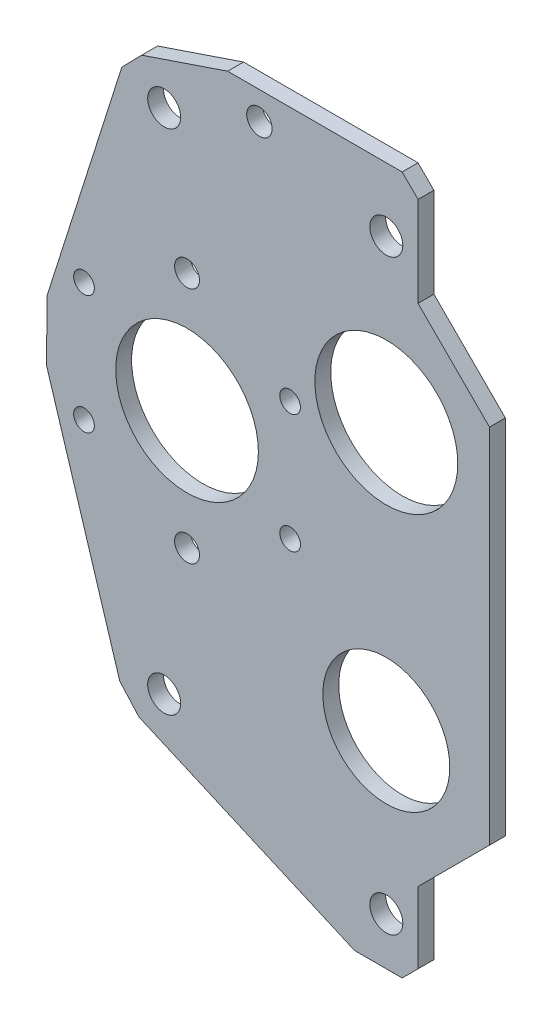
ISO-10303-21;
HEADER;
FILE_DESCRIPTION(('STEP AP214'),'2;1');
FILE_NAME('part.step','',(''),(''),'','','');
FILE_SCHEMA(('AUTOMOTIVE_DESIGN { 1 0 10303 214 1 1 1 1 }'));
ENDSEC;
DATA;
#1=APPLICATION_CONTEXT('core data for automotive mechanical design processes');
#2=APPLICATION_PROTOCOL_DEFINITION('international standard','automotive_design',2000,#1);
#3=PRODUCT_CONTEXT('',#1,'mechanical');
#4=PRODUCT('Part','Part','',(#3));
#5=PRODUCT_RELATED_PRODUCT_CATEGORY('part','',(#4));
#6=PRODUCT_DEFINITION_FORMATION('','',#4);
#7=PRODUCT_DEFINITION_CONTEXT('part definition',#1,'design');
#8=PRODUCT_DEFINITION('design','',#6,#7);
#9=PRODUCT_DEFINITION_SHAPE('','',#8);
#10=(LENGTH_UNIT() NAMED_UNIT(*) SI_UNIT(.MILLI.,.METRE.));
#11=(NAMED_UNIT(*) PLANE_ANGLE_UNIT() SI_UNIT($,.RADIAN.));
#12=(NAMED_UNIT(*) SI_UNIT($,.STERADIAN.) SOLID_ANGLE_UNIT());
#13=UNCERTAINTY_MEASURE_WITH_UNIT(LENGTH_MEASURE(1.E-05),#10,'distance_accuracy_value','');
#14=(GEOMETRIC_REPRESENTATION_CONTEXT(3) GLOBAL_UNCERTAINTY_ASSIGNED_CONTEXT((#13)) GLOBAL_UNIT_ASSIGNED_CONTEXT((#10,
#11,#12)) REPRESENTATION_CONTEXT('',''));
#15=CARTESIAN_POINT('',(0.,0.,0.));
#16=DIRECTION('',(0.,0.,1.));
#17=DIRECTION('',(1.,0.,0.));
#18=AXIS2_PLACEMENT_3D('',#15,#16,#17);
#19=CARTESIAN_POINT('',(0.,0.,0.));
#20=DIRECTION('',(0.,0.,1.));
#21=DIRECTION('',(1.,0.,0.));
#22=AXIS2_PLACEMENT_3D('',#19,#20,#21);
#23=PLANE('',#22);
#24=DIRECTION('',(-0.947188076798087,-0.32067857298476,0.));
#25=VECTOR('',#24,1.);
#26=CARTESIAN_POINT('',(-33.1609002039906,97.9473277455423,0.));
#27=LINE('',#26,#25);
#28=CARTESIAN_POINT('',(-48.9538078594664,92.6005046443076,0.));
#29=VERTEX_POINT('',#28);
#30=CARTESIAN_POINT('',(-31.75,98.425,0.));
#31=VERTEX_POINT('',#30);
#32=EDGE_CURVE('E696',#29,#31,#27,.F.);
#33=ORIENTED_EDGE('',*,*,#32,.F.);
#34=DIRECTION('',(0.7004757379388,0.713676215492077,0.));
#35=VECTOR('',#34,1.);
#36=CARTESIAN_POINT('',(-48.9538078594664,92.6005046443076,0.));
#37=LINE('',#36,#35);
#38=CARTESIAN_POINT('',(-52.9229679271194,88.5565456856429,0.));
#39=VERTEX_POINT('',#38);
#40=EDGE_CURVE('E688',#29,#39,#37,.F.);
#41=ORIENTED_EDGE('',*,*,#40,.T.);
#42=DIRECTION('',(-0.302941078368201,-0.953009288011985,0.));
#43=VECTOR('',#42,1.);
#44=CARTESIAN_POINT('',(-73.6328287693253,23.4062866241446,0.));
#45=LINE('',#44,#43);
#46=CARTESIAN_POINT('',(-67.9263241523619,41.3581336676134,0.));
#47=VERTEX_POINT('',#46);
#48=EDGE_CURVE('E686',#47,#39,#45,.F.);
#49=ORIENTED_EDGE('',*,*,#48,.F.);
#50=DIRECTION('',(0.00396394921512312,0.999992143522448,0.));
#51=VECTOR('',#50,1.);
#52=CARTESIAN_POINT('',(-67.9263241523619,41.3581336676133,0.));
#53=LINE('',#52,#51);
#54=CARTESIAN_POINT('',(-67.9743607697863,29.2398552995184,0.));
#55=VERTEX_POINT('',#54);
#56=EDGE_CURVE('E679',#47,#55,#53,.F.);
#57=ORIENTED_EDGE('',*,*,#56,.T.);
#58=DIRECTION('',(0.295376256726555,-0.955381006176179,0.));
#59=VECTOR('',#58,1.);
#60=CARTESIAN_POINT('',(-53.7923971636767,-16.6310579882147,0.));
#61=LINE('',#60,#59);
#62=CARTESIAN_POINT('',(-53.3456573135953,-18.0760176210564,0.));
#63=VERTEX_POINT('',#62);
#64=EDGE_CURVE('E145',#63,#55,#61,.F.);
#65=ORIENTED_EDGE('',*,*,#64,.F.);
#66=DIRECTION('',(-0.666107578502949,0.745855678976126,0.));
#67=VECTOR('',#66,1.);
#68=CARTESIAN_POINT('',(-53.3456573135953,-18.0760176210564,0.));
#69=LINE('',#68,#67);
#70=CARTESIAN_POINT('',(-49.4993940732019,-22.3827653195768,0.));
#71=VERTEX_POINT('',#70);
#72=EDGE_CURVE('E140',#63,#71,#69,.F.);
#73=ORIENTED_EDGE('',*,*,#72,.T.);
#74=DIRECTION('',(0.916045236310745,-0.401074961861734,0.));
#75=VECTOR('',#74,1.);
#76=CARTESIAN_POINT('',(-16.1860190531105,-36.9684648964657,0.));
#77=LINE('',#76,#75);
#78=CARTESIAN_POINT('',(-6.34999999999987,-41.275,0.));
#79=VERTEX_POINT('',#78);
#80=EDGE_CURVE('E131',#79,#71,#77,.F.);
#81=ORIENTED_EDGE('',*,*,#80,.F.);
#82=DIRECTION('',(1.,0.,0.));
#83=VECTOR('',#82,1.);
#84=CARTESIAN_POINT('',(-76.2,-41.275,0.));
#85=LINE('',#84,#83);
#86=CARTESIAN_POINT('',(3.17499999999999,-41.275,0.));
#87=VERTEX_POINT('',#86);
#88=EDGE_CURVE('E126',#87,#79,#85,.F.);
#89=ORIENTED_EDGE('',*,*,#88,.F.);
#90=DIRECTION('',(0.707106781186547,0.707106781186548,0.));
#91=VECTOR('',#90,1.);
#92=CARTESIAN_POINT('',(6.35,-38.1,0.));
#93=LINE('',#92,#91);
#94=CARTESIAN_POINT('',(6.35,-38.1,0.));
#95=VERTEX_POINT('',#94);
#96=EDGE_CURVE('E733',#95,#87,#93,.F.);
#97=ORIENTED_EDGE('',*,*,#96,.F.);
#98=DIRECTION('',(0.,-1.,0.));
#99=VECTOR('',#98,1.);
#100=CARTESIAN_POINT('',(6.35000000000001,-23.8252,0.));
#101=LINE('',#100,#99);
#102=CARTESIAN_POINT('',(6.35,-23.8252,0.));
#103=VERTEX_POINT('',#102);
#104=EDGE_CURVE('E727',#95,#103,#101,.F.);
#105=ORIENTED_EDGE('',*,*,#104,.T.);
#106=DIRECTION('',(-0.707106781186549,-0.707106781186546,0.));
#107=VECTOR('',#106,1.);
#108=CARTESIAN_POINT('',(20.6502,-9.525,0.));
#109=LINE('',#108,#107);
#110=CARTESIAN_POINT('',(20.6502,-9.52500000000001,0.));
#111=VERTEX_POINT('',#110);
#112=EDGE_CURVE('E722',#103,#111,#109,.F.);
#113=ORIENTED_EDGE('',*,*,#112,.T.);
#114=DIRECTION('',(0.,-1.,0.));
#115=VECTOR('',#114,1.);
#116=CARTESIAN_POINT('',(20.6502,62.9412,0.));
#117=LINE('',#116,#115);
#118=CARTESIAN_POINT('',(20.6502,62.9412,0.));
#119=VERTEX_POINT('',#118);
#120=EDGE_CURVE('E717',#111,#119,#117,.F.);
#121=ORIENTED_EDGE('',*,*,#120,.T.);
#122=DIRECTION('',(0.707106781186549,-0.707106781186546,0.));
#123=VECTOR('',#122,1.);
#124=CARTESIAN_POINT('',(6.35000000000002,77.2414,0.));
#125=LINE('',#124,#123);
#126=CARTESIAN_POINT('',(6.35000000000002,77.2414,0.));
#127=VERTEX_POINT('',#126);
#128=EDGE_CURVE('E712',#119,#127,#125,.F.);
#129=ORIENTED_EDGE('',*,*,#128,.T.);
#130=DIRECTION('',(0.,-1.,0.));
#131=VECTOR('',#130,1.);
#132=CARTESIAN_POINT('',(6.35000000000002,98.425,0.));
#133=LINE('',#132,#131);
#134=CARTESIAN_POINT('',(6.35000000000002,95.25,0.));
#135=VERTEX_POINT('',#134);
#136=EDGE_CURVE('E706',#127,#135,#133,.F.);
#137=ORIENTED_EDGE('',*,*,#136,.T.);
#138=DIRECTION('',(-0.707106781186547,0.707106781186548,0.));
#139=VECTOR('',#138,1.);
#140=CARTESIAN_POINT('',(3.17500000000003,98.425,0.));
#141=LINE('',#140,#139);
#142=CARTESIAN_POINT('',(3.17500000000003,98.425,0.));
#143=VERTEX_POINT('',#142);
#144=EDGE_CURVE('E704',#143,#135,#141,.F.);
#145=ORIENTED_EDGE('',*,*,#144,.F.);
#146=DIRECTION('',(1.,0.,0.));
#147=VECTOR('',#146,1.);
#148=CARTESIAN_POINT('',(-76.2,98.425,0.));
#149=LINE('',#148,#147);
#150=EDGE_CURVE('E700',#31,#143,#149,.T.);
#151=ORIENTED_EDGE('',*,*,#150,.F.);
#152=EDGE_LOOP('',(#33,#41,#49,#57,#65,#73,#81,#89,#97,#105,#113,#121,#129,#137,#145,#151));
#153=FACE_BOUND('',#152,.T.);
#154=CARTESIAN_POINT('',(0.,-31.75,0.));
#155=DIRECTION('',(0.,0.,1.));
#156=DIRECTION('',(1.,0.,0.));
#157=AXIS2_PLACEMENT_3D('',#154,#155,#156);
#158=CIRCLE('',#157,3.302);
#159=CARTESIAN_POINT('',(3.30199999999998,-31.75,0.));
#160=VERTEX_POINT('',#159);
#161=EDGE_CURVE('E149',#160,#160,#158,.F.);
#162=ORIENTED_EDGE('',*,*,#161,.T.);
#163=EDGE_LOOP('',(#162));
#164=FACE_BOUND('',#163,.T.);
#165=CARTESIAN_POINT('',(0.,85.725,0.));
#166=DIRECTION('',(0.,0.,1.));
#167=DIRECTION('',(1.,0.,0.));
#168=AXIS2_PLACEMENT_3D('',#165,#166,#167);
#169=CIRCLE('',#168,3.30199999999999);
#170=CARTESIAN_POINT('',(3.30199999999996,85.725,0.));
#171=VERTEX_POINT('',#170);
#172=EDGE_CURVE('E203',#171,#171,#169,.F.);
#173=ORIENTED_EDGE('',*,*,#172,.T.);
#174=EDGE_LOOP('',(#173));
#175=FACE_BOUND('',#174,.T.);
#176=CARTESIAN_POINT('',(-25.4,92.8624,0.));
#177=DIRECTION('',(0.,0.,1.));
#178=DIRECTION('',(1.,0.,0.));
#179=AXIS2_PLACEMENT_3D('',#176,#177,#178);
#180=CIRCLE('',#179,2.54);
#181=CARTESIAN_POINT('',(-22.86,92.8624,0.));
#182=VERTEX_POINT('',#181);
#183=EDGE_CURVE('E206',#182,#182,#180,.F.);
#184=ORIENTED_EDGE('',*,*,#183,.T.);
#185=EDGE_LOOP('',(#184));
#186=FACE_BOUND('',#185,.T.);
#187=CARTESIAN_POINT('',(0.,53.4162,0.));
#188=DIRECTION('',(0.,0.,1.));
#189=DIRECTION('',(1.,0.,0.));
#190=AXIS2_PLACEMENT_3D('',#187,#188,#189);
#191=CIRCLE('',#190,14.3002);
#192=CARTESIAN_POINT('',(14.3002,53.4162,0.));
#193=VERTEX_POINT('',#192);
#194=EDGE_CURVE('E209',#193,#193,#191,.F.);
#195=ORIENTED_EDGE('',*,*,#194,.T.);
#196=EDGE_LOOP('',(#195));
#197=FACE_BOUND('',#196,.T.);
#198=CARTESIAN_POINT('',(-39.878,35.5392112804997,0.));
#199=DIRECTION('',(0.,0.,1.));
#200=DIRECTION('',(1.,0.,0.));
#201=AXIS2_PLACEMENT_3D('',#198,#199,#200);
#202=CIRCLE('',#201,14.2748);
#203=CARTESIAN_POINT('',(-25.6032,35.5392112804997,0.));
#204=VERTEX_POINT('',#203);
#205=EDGE_CURVE('E212',#204,#204,#202,.F.);
#206=ORIENTED_EDGE('',*,*,#205,.T.);
#207=EDGE_LOOP('',(#206));
#208=FACE_BOUND('',#207,.T.);
#209=CARTESIAN_POINT('',(0.,0.,0.));
#210=DIRECTION('',(0.,0.,1.));
#211=DIRECTION('',(1.,0.,0.));
#212=AXIS2_PLACEMENT_3D('',#209,#210,#211);
#213=CIRCLE('',#212,12.7);
#214=CARTESIAN_POINT('',(12.7,0.,0.));
#215=VERTEX_POINT('',#214);
#216=EDGE_CURVE('E215',#215,#215,#213,.F.);
#217=ORIENTED_EDGE('',*,*,#216,.T.);
#218=EDGE_LOOP('',(#217));
#219=FACE_BOUND('',#218,.T.);
#220=CARTESIAN_POINT('',(-44.45,-15.875,0.));
#221=DIRECTION('',(0.,0.,1.));
#222=DIRECTION('',(1.,0.,0.));
#223=AXIS2_PLACEMENT_3D('',#220,#221,#222);
#224=CIRCLE('',#223,3.302);
#225=CARTESIAN_POINT('',(-41.148,-15.875,0.));
#226=VERTEX_POINT('',#225);
#227=EDGE_CURVE('E218',#226,#226,#224,.F.);
#228=ORIENTED_EDGE('',*,*,#227,.T.);
#229=EDGE_LOOP('',(#228));
#230=FACE_BOUND('',#229,.T.);
#231=CARTESIAN_POINT('',(-44.45,85.725,0.));
#232=DIRECTION('',(0.,0.,1.));
#233=DIRECTION('',(1.,0.,0.));
#234=AXIS2_PLACEMENT_3D('',#231,#232,#233);
#235=CIRCLE('',#234,3.302);
#236=CARTESIAN_POINT('',(-41.148,85.725,0.));
#237=VERTEX_POINT('',#236);
#238=EDGE_CURVE('E221',#237,#237,#235,.F.);
#239=ORIENTED_EDGE('',*,*,#238,.T.);
#240=EDGE_LOOP('',(#239));
#241=FACE_BOUND('',#240,.T.);
#242=CARTESIAN_POINT('',(-39.878,11.7267112804997,0.));
#243=DIRECTION('',(0.,0.,-1.));
#244=DIRECTION('',(-1.,0.,0.));
#245=AXIS2_PLACEMENT_3D('',#242,#243,#244);
#246=CIRCLE('',#245,2.4892);
#247=CARTESIAN_POINT('',(-42.3672,11.7267112804997,0.));
#248=VERTEX_POINT('',#247);
#249=EDGE_CURVE('E224',#248,#248,#246,.T.);
#250=ORIENTED_EDGE('',*,*,#249,.T.);
#251=EDGE_LOOP('',(#250));
#252=FACE_BOUND('',#251,.T.);
#253=CARTESIAN_POINT('',(-19.255770072383,23.6329612804998,0.));
#254=DIRECTION('',(0.,0.,-1.));
#255=DIRECTION('',(-1.,0.,0.));
#256=AXIS2_PLACEMENT_3D('',#253,#254,#255);
#257=CIRCLE('',#256,2.0701);
#258=CARTESIAN_POINT('',(-21.325870072383,23.6329612804998,0.));
#259=VERTEX_POINT('',#258);
#260=EDGE_CURVE('E227',#259,#259,#257,.T.);
#261=ORIENTED_EDGE('',*,*,#260,.T.);
#262=EDGE_LOOP('',(#261));
#263=FACE_BOUND('',#262,.T.);
#264=CARTESIAN_POINT('',(-19.2557700723831,47.4454612804998,0.));
#265=DIRECTION('',(0.,0.,-1.));
#266=DIRECTION('',(-1.,0.,0.));
#267=AXIS2_PLACEMENT_3D('',#264,#265,#266);
#268=CIRCLE('',#267,2.07010000000001);
#269=CARTESIAN_POINT('',(-21.3258700723831,47.4454612804998,0.));
#270=VERTEX_POINT('',#269);
#271=EDGE_CURVE('E230',#270,#270,#268,.T.);
#272=ORIENTED_EDGE('',*,*,#271,.T.);
#273=EDGE_LOOP('',(#272));
#274=FACE_BOUND('',#273,.T.);
#275=CARTESIAN_POINT('',(-39.878,59.3517112804997,0.));
#276=DIRECTION('',(0.,0.,-1.));
#277=DIRECTION('',(-1.,0.,0.));
#278=AXIS2_PLACEMENT_3D('',#275,#276,#277);
#279=CIRCLE('',#278,2.4892);
#280=CARTESIAN_POINT('',(-42.3672,59.3517112804997,0.));
#281=VERTEX_POINT('',#280);
#282=EDGE_CURVE('E233',#281,#281,#279,.T.);
#283=ORIENTED_EDGE('',*,*,#282,.T.);
#284=EDGE_LOOP('',(#283));
#285=FACE_BOUND('',#284,.T.);
#286=CARTESIAN_POINT('',(-60.5002299276169,23.6329612804996,0.));
#287=DIRECTION('',(0.,0.,-1.));
#288=DIRECTION('',(-1.,0.,0.));
#289=AXIS2_PLACEMENT_3D('',#286,#287,#288);
#290=CIRCLE('',#289,2.0701);
#291=CARTESIAN_POINT('',(-62.5703299276169,23.6329612804996,0.));
#292=VERTEX_POINT('',#291);
#293=EDGE_CURVE('E235',#292,#292,#290,.T.);
#294=ORIENTED_EDGE('',*,*,#293,.T.);
#295=EDGE_LOOP('',(#294));
#296=FACE_BOUND('',#295,.T.);
#297=CARTESIAN_POINT('',(-60.500229927617,47.4454612804997,0.));
#298=DIRECTION('',(0.,0.,-1.));
#299=DIRECTION('',(-1.,0.,0.));
#300=AXIS2_PLACEMENT_3D('',#297,#298,#299);
#301=CIRCLE('',#300,2.07009999999999);
#302=CARTESIAN_POINT('',(-62.570329927617,47.4454612804997,0.));
#303=VERTEX_POINT('',#302);
#304=EDGE_CURVE('E20',#303,#303,#301,.T.);
#305=ORIENTED_EDGE('',*,*,#304,.T.);
#306=EDGE_LOOP('',(#305));
#307=FACE_BOUND('',#306,.T.);
#308=ADVANCED_FACE('F17',(#153,#164,#175,#186,#197,#208,#219,#230,#241,#252,#263,#274,#285,#296,
#307),#23,.T.);
#309=CARTESIAN_POINT('',(-60.500229927617,47.4454612804997,0.));
#310=DIRECTION('',(0.,0.,-1.));
#311=DIRECTION('',(-1.,0.,0.));
#312=AXIS2_PLACEMENT_3D('',#309,#310,#311);
#313=CYLINDRICAL_SURFACE('',#312,2.07009999999999);
#314=ORIENTED_EDGE('',*,*,#304,.F.);
#315=EDGE_LOOP('',(#314));
#316=FACE_BOUND('',#315,.T.);
#317=CARTESIAN_POINT('',(-60.500229927617,47.4454612804997,-3.175));
#318=DIRECTION('',(0.,0.,-1.));
#319=DIRECTION('',(-1.,0.,0.));
#320=AXIS2_PLACEMENT_3D('',#317,#318,#319);
#321=CIRCLE('',#320,2.07009999999999);
#322=CARTESIAN_POINT('',(-62.570329927617,47.4454612804997,-3.175));
#323=VERTEX_POINT('',#322);
#324=EDGE_CURVE('E197',#323,#323,#321,.T.);
#325=ORIENTED_EDGE('',*,*,#324,.T.);
#326=EDGE_LOOP('',(#325));
#327=FACE_BOUND('',#326,.T.);
#328=ADVANCED_FACE('F243',(#316,#327),#313,.F.);
#329=CARTESIAN_POINT('',(-60.5002299276169,23.6329612804996,0.));
#330=DIRECTION('',(0.,0.,-1.));
#331=DIRECTION('',(-1.,0.,0.));
#332=AXIS2_PLACEMENT_3D('',#329,#330,#331);
#333=CYLINDRICAL_SURFACE('',#332,2.0701);
#334=ORIENTED_EDGE('',*,*,#293,.F.);
#335=EDGE_LOOP('',(#334));
#336=FACE_BOUND('',#335,.T.);
#337=CARTESIAN_POINT('',(-60.5002299276169,23.6329612804996,-3.175));
#338=DIRECTION('',(0.,0.,-1.));
#339=DIRECTION('',(-1.,0.,0.));
#340=AXIS2_PLACEMENT_3D('',#337,#338,#339);
#341=CIRCLE('',#340,2.0701);
#342=CARTESIAN_POINT('',(-62.5703299276169,23.6329612804996,-3.175));
#343=VERTEX_POINT('',#342);
#344=EDGE_CURVE('E194',#343,#343,#341,.T.);
#345=ORIENTED_EDGE('',*,*,#344,.T.);
#346=EDGE_LOOP('',(#345));
#347=FACE_BOUND('',#346,.T.);
#348=ADVANCED_FACE('F246',(#336,#347),#333,.F.);
#349=CARTESIAN_POINT('',(-39.878,59.3517112804997,0.));
#350=DIRECTION('',(0.,0.,-1.));
#351=DIRECTION('',(-1.,0.,0.));
#352=AXIS2_PLACEMENT_3D('',#349,#350,#351);
#353=CYLINDRICAL_SURFACE('',#352,2.4892);
#354=ORIENTED_EDGE('',*,*,#282,.F.);
#355=EDGE_LOOP('',(#354));
#356=FACE_BOUND('',#355,.T.);
#357=CARTESIAN_POINT('',(-39.878,59.3517112804997,-3.175));
#358=DIRECTION('',(0.,0.,-1.));
#359=DIRECTION('',(-1.,0.,0.));
#360=AXIS2_PLACEMENT_3D('',#357,#358,#359);
#361=CIRCLE('',#360,2.4892);
#362=CARTESIAN_POINT('',(-42.3672,59.3517112804997,-3.175));
#363=VERTEX_POINT('',#362);
#364=EDGE_CURVE('E191',#363,#363,#361,.T.);
#365=ORIENTED_EDGE('',*,*,#364,.T.);
#366=EDGE_LOOP('',(#365));
#367=FACE_BOUND('',#366,.T.);
#368=ADVANCED_FACE('F360',(#356,#367),#353,.F.);
#369=CARTESIAN_POINT('',(-19.2557700723831,47.4454612804998,0.));
#370=DIRECTION('',(0.,0.,-1.));
#371=DIRECTION('',(-1.,0.,0.));
#372=AXIS2_PLACEMENT_3D('',#369,#370,#371);
#373=CYLINDRICAL_SURFACE('',#372,2.07010000000001);
#374=ORIENTED_EDGE('',*,*,#271,.F.);
#375=EDGE_LOOP('',(#374));
#376=FACE_BOUND('',#375,.T.);
#377=CARTESIAN_POINT('',(-19.2557700723831,47.4454612804998,-3.175));
#378=DIRECTION('',(0.,0.,-1.));
#379=DIRECTION('',(-1.,0.,0.));
#380=AXIS2_PLACEMENT_3D('',#377,#378,#379);
#381=CIRCLE('',#380,2.07010000000001);
#382=CARTESIAN_POINT('',(-21.3258700723831,47.4454612804998,-3.175));
#383=VERTEX_POINT('',#382);
#384=EDGE_CURVE('E188',#383,#383,#381,.T.);
#385=ORIENTED_EDGE('',*,*,#384,.T.);
#386=EDGE_LOOP('',(#385));
#387=FACE_BOUND('',#386,.T.);
#388=ADVANCED_FACE('F356',(#376,#387),#373,.F.);
#389=CARTESIAN_POINT('',(-19.255770072383,23.6329612804998,0.));
#390=DIRECTION('',(0.,0.,-1.));
#391=DIRECTION('',(-1.,0.,0.));
#392=AXIS2_PLACEMENT_3D('',#389,#390,#391);
#393=CYLINDRICAL_SURFACE('',#392,2.0701);
#394=ORIENTED_EDGE('',*,*,#260,.F.);
#395=EDGE_LOOP('',(#394));
#396=FACE_BOUND('',#395,.T.);
#397=CARTESIAN_POINT('',(-19.255770072383,23.6329612804998,-3.175));
#398=DIRECTION('',(0.,0.,-1.));
#399=DIRECTION('',(-1.,0.,0.));
#400=AXIS2_PLACEMENT_3D('',#397,#398,#399);
#401=CIRCLE('',#400,2.0701);
#402=CARTESIAN_POINT('',(-21.325870072383,23.6329612804998,-3.175));
#403=VERTEX_POINT('',#402);
#404=EDGE_CURVE('E185',#403,#403,#401,.T.);
#405=ORIENTED_EDGE('',*,*,#404,.T.);
#406=EDGE_LOOP('',(#405));
#407=FACE_BOUND('',#406,.T.);
#408=ADVANCED_FACE('F352',(#396,#407),#393,.F.);
#409=CARTESIAN_POINT('',(-39.878,11.7267112804997,0.));
#410=DIRECTION('',(0.,0.,-1.));
#411=DIRECTION('',(-1.,0.,0.));
#412=AXIS2_PLACEMENT_3D('',#409,#410,#411);
#413=CYLINDRICAL_SURFACE('',#412,2.4892);
#414=ORIENTED_EDGE('',*,*,#249,.F.);
#415=EDGE_LOOP('',(#414));
#416=FACE_BOUND('',#415,.T.);
#417=CARTESIAN_POINT('',(-39.878,11.7267112804997,-3.175));
#418=DIRECTION('',(0.,0.,-1.));
#419=DIRECTION('',(-1.,0.,0.));
#420=AXIS2_PLACEMENT_3D('',#417,#418,#419);
#421=CIRCLE('',#420,2.4892);
#422=CARTESIAN_POINT('',(-42.3672,11.7267112804997,-3.175));
#423=VERTEX_POINT('',#422);
#424=EDGE_CURVE('E182',#423,#423,#421,.T.);
#425=ORIENTED_EDGE('',*,*,#424,.T.);
#426=EDGE_LOOP('',(#425));
#427=FACE_BOUND('',#426,.T.);
#428=ADVANCED_FACE('F348',(#416,#427),#413,.F.);
#429=CARTESIAN_POINT('',(-44.45,85.725,-3.175));
#430=DIRECTION('',(0.,0.,1.));
#431=DIRECTION('',(1.,0.,0.));
#432=AXIS2_PLACEMENT_3D('',#429,#430,#431);
#433=CYLINDRICAL_SURFACE('',#432,3.302);
#434=CARTESIAN_POINT('',(-44.45,85.725,-3.175));
#435=DIRECTION('',(0.,0.,1.));
#436=DIRECTION('',(1.,0.,0.));
#437=AXIS2_PLACEMENT_3D('',#434,#435,#436);
#438=CIRCLE('',#437,3.302);
#439=CARTESIAN_POINT('',(-41.148,85.725,-3.175));
#440=VERTEX_POINT('',#439);
#441=EDGE_CURVE('E179',#440,#440,#438,.F.);
#442=ORIENTED_EDGE('',*,*,#441,.T.);
#443=EDGE_LOOP('',(#442));
#444=FACE_BOUND('',#443,.T.);
#445=ORIENTED_EDGE('',*,*,#238,.F.);
#446=EDGE_LOOP('',(#445));
#447=FACE_BOUND('',#446,.T.);
#448=ADVANCED_FACE('F344',(#444,#447),#433,.F.);
#449=CARTESIAN_POINT('',(-44.45,-15.875,-3.175));
#450=DIRECTION('',(0.,0.,1.));
#451=DIRECTION('',(1.,0.,0.));
#452=AXIS2_PLACEMENT_3D('',#449,#450,#451);
#453=CYLINDRICAL_SURFACE('',#452,3.302);
#454=CARTESIAN_POINT('',(-44.45,-15.875,-3.175));
#455=DIRECTION('',(0.,0.,1.));
#456=DIRECTION('',(1.,0.,0.));
#457=AXIS2_PLACEMENT_3D('',#454,#455,#456);
#458=CIRCLE('',#457,3.302);
#459=CARTESIAN_POINT('',(-41.148,-15.875,-3.175));
#460=VERTEX_POINT('',#459);
#461=EDGE_CURVE('E176',#460,#460,#458,.F.);
#462=ORIENTED_EDGE('',*,*,#461,.T.);
#463=EDGE_LOOP('',(#462));
#464=FACE_BOUND('',#463,.T.);
#465=ORIENTED_EDGE('',*,*,#227,.F.);
#466=EDGE_LOOP('',(#465));
#467=FACE_BOUND('',#466,.T.);
#468=ADVANCED_FACE('F340',(#464,#467),#453,.F.);
#469=CARTESIAN_POINT('',(0.,0.,-3.175));
#470=DIRECTION('',(0.,0.,1.));
#471=DIRECTION('',(1.,0.,0.));
#472=AXIS2_PLACEMENT_3D('',#469,#470,#471);
#473=CYLINDRICAL_SURFACE('',#472,12.7);
#474=CARTESIAN_POINT('',(0.,0.,-3.175));
#475=DIRECTION('',(0.,0.,1.));
#476=DIRECTION('',(1.,0.,0.));
#477=AXIS2_PLACEMENT_3D('',#474,#475,#476);
#478=CIRCLE('',#477,12.7);
#479=CARTESIAN_POINT('',(12.7,0.,-3.175));
#480=VERTEX_POINT('',#479);
#481=EDGE_CURVE('E173',#480,#480,#478,.F.);
#482=ORIENTED_EDGE('',*,*,#481,.T.);
#483=EDGE_LOOP('',(#482));
#484=FACE_BOUND('',#483,.T.);
#485=ORIENTED_EDGE('',*,*,#216,.F.);
#486=EDGE_LOOP('',(#485));
#487=FACE_BOUND('',#486,.T.);
#488=ADVANCED_FACE('F336',(#484,#487),#473,.F.);
#489=CARTESIAN_POINT('',(-39.878,35.5392112804997,-3.175));
#490=DIRECTION('',(0.,0.,1.));
#491=DIRECTION('',(1.,0.,0.));
#492=AXIS2_PLACEMENT_3D('',#489,#490,#491);
#493=CYLINDRICAL_SURFACE('',#492,14.2748);
#494=CARTESIAN_POINT('',(-39.878,35.5392112804997,-3.175));
#495=DIRECTION('',(0.,0.,1.));
#496=DIRECTION('',(1.,0.,0.));
#497=AXIS2_PLACEMENT_3D('',#494,#495,#496);
#498=CIRCLE('',#497,14.2748);
#499=CARTESIAN_POINT('',(-25.6032,35.5392112804997,-3.175));
#500=VERTEX_POINT('',#499);
#501=EDGE_CURVE('E170',#500,#500,#498,.F.);
#502=ORIENTED_EDGE('',*,*,#501,.T.);
#503=EDGE_LOOP('',(#502));
#504=FACE_BOUND('',#503,.T.);
#505=ORIENTED_EDGE('',*,*,#205,.F.);
#506=EDGE_LOOP('',(#505));
#507=FACE_BOUND('',#506,.T.);
#508=ADVANCED_FACE('F332',(#504,#507),#493,.F.);
#509=CARTESIAN_POINT('',(0.,53.4162,-3.175));
#510=DIRECTION('',(0.,0.,1.));
#511=DIRECTION('',(1.,0.,0.));
#512=AXIS2_PLACEMENT_3D('',#509,#510,#511);
#513=CYLINDRICAL_SURFACE('',#512,14.3002);
#514=CARTESIAN_POINT('',(0.,53.4162,-3.175));
#515=DIRECTION('',(0.,0.,1.));
#516=DIRECTION('',(1.,0.,0.));
#517=AXIS2_PLACEMENT_3D('',#514,#515,#516);
#518=CIRCLE('',#517,14.3002);
#519=CARTESIAN_POINT('',(14.3002,53.4162,-3.175));
#520=VERTEX_POINT('',#519);
#521=EDGE_CURVE('E167',#520,#520,#518,.F.);
#522=ORIENTED_EDGE('',*,*,#521,.T.);
#523=EDGE_LOOP('',(#522));
#524=FACE_BOUND('',#523,.T.);
#525=ORIENTED_EDGE('',*,*,#194,.F.);
#526=EDGE_LOOP('',(#525));
#527=FACE_BOUND('',#526,.T.);
#528=ADVANCED_FACE('F328',(#524,#527),#513,.F.);
#529=CARTESIAN_POINT('',(-25.4,92.8624,-3.175));
#530=DIRECTION('',(0.,0.,1.));
#531=DIRECTION('',(1.,0.,0.));
#532=AXIS2_PLACEMENT_3D('',#529,#530,#531);
#533=CYLINDRICAL_SURFACE('',#532,2.54);
#534=CARTESIAN_POINT('',(-25.4,92.8624,-3.175));
#535=DIRECTION('',(0.,0.,1.));
#536=DIRECTION('',(1.,0.,0.));
#537=AXIS2_PLACEMENT_3D('',#534,#535,#536);
#538=CIRCLE('',#537,2.54);
#539=CARTESIAN_POINT('',(-22.86,92.8624,-3.175));
#540=VERTEX_POINT('',#539);
#541=EDGE_CURVE('E164',#540,#540,#538,.F.);
#542=ORIENTED_EDGE('',*,*,#541,.T.);
#543=EDGE_LOOP('',(#542));
#544=FACE_BOUND('',#543,.T.);
#545=ORIENTED_EDGE('',*,*,#183,.F.);
#546=EDGE_LOOP('',(#545));
#547=FACE_BOUND('',#546,.T.);
#548=ADVANCED_FACE('F324',(#544,#547),#533,.F.);
#549=CARTESIAN_POINT('',(0.,85.725,-3.175));
#550=DIRECTION('',(0.,0.,1.));
#551=DIRECTION('',(1.,0.,0.));
#552=AXIS2_PLACEMENT_3D('',#549,#550,#551);
#553=CYLINDRICAL_SURFACE('',#552,3.30199999999999);
#554=CARTESIAN_POINT('',(0.,85.725,-3.175));
#555=DIRECTION('',(0.,0.,1.));
#556=DIRECTION('',(1.,0.,0.));
#557=AXIS2_PLACEMENT_3D('',#554,#555,#556);
#558=CIRCLE('',#557,3.30199999999999);
#559=CARTESIAN_POINT('',(3.30199999999996,85.725,-3.175));
#560=VERTEX_POINT('',#559);
#561=EDGE_CURVE('E161',#560,#560,#558,.F.);
#562=ORIENTED_EDGE('',*,*,#561,.T.);
#563=EDGE_LOOP('',(#562));
#564=FACE_BOUND('',#563,.T.);
#565=ORIENTED_EDGE('',*,*,#172,.F.);
#566=EDGE_LOOP('',(#565));
#567=FACE_BOUND('',#566,.T.);
#568=ADVANCED_FACE('F320',(#564,#567),#553,.F.);
#569=CARTESIAN_POINT('',(0.,-31.75,-3.175));
#570=DIRECTION('',(0.,0.,1.));
#571=DIRECTION('',(1.,0.,0.));
#572=AXIS2_PLACEMENT_3D('',#569,#570,#571);
#573=CYLINDRICAL_SURFACE('',#572,3.302);
#574=CARTESIAN_POINT('',(0.,-31.75,-3.175));
#575=DIRECTION('',(0.,0.,1.));
#576=DIRECTION('',(1.,0.,0.));
#577=AXIS2_PLACEMENT_3D('',#574,#575,#576);
#578=CIRCLE('',#577,3.302);
#579=CARTESIAN_POINT('',(3.30199999999998,-31.75,-3.175));
#580=VERTEX_POINT('',#579);
#581=EDGE_CURVE('E158',#580,#580,#578,.F.);
#582=ORIENTED_EDGE('',*,*,#581,.T.);
#583=EDGE_LOOP('',(#582));
#584=FACE_BOUND('',#583,.T.);
#585=ORIENTED_EDGE('',*,*,#161,.F.);
#586=EDGE_LOOP('',(#585));
#587=FACE_BOUND('',#586,.T.);
#588=ADVANCED_FACE('F317',(#584,#587),#573,.F.);
#589=CARTESIAN_POINT('',(-53.3456573135953,-18.0760176210564,-3.175));
#590=DIRECTION('',(0.745855678976126,0.666107578502949,0.));
#591=DIRECTION('',(-0.666107578502949,0.745855678976126,0.));
#592=AXIS2_PLACEMENT_3D('',#589,#590,#591);
#593=PLANE('',#592);
#594=DIRECTION('',(0.,0.,1.));
#595=VECTOR('',#594,1.);
#596=CARTESIAN_POINT('',(-49.4993940732019,-22.3827653195767,-3.175));
#597=LINE('',#596,#595);
#598=CARTESIAN_POINT('',(-49.4993940732019,-22.3827653195768,-3.175));
#599=VERTEX_POINT('',#598);
#600=EDGE_CURVE('E136',#71,#599,#597,.F.);
#601=ORIENTED_EDGE('',*,*,#600,.F.);
#602=ORIENTED_EDGE('',*,*,#72,.F.);
#603=DIRECTION('',(0.,0.,1.));
#604=VECTOR('',#603,1.);
#605=CARTESIAN_POINT('',(-53.3456573135953,-18.0760176210564,-3.175));
#606=LINE('',#605,#604);
#607=CARTESIAN_POINT('',(-53.3456573135953,-18.0760176210564,-3.175));
#608=VERTEX_POINT('',#607);
#609=EDGE_CURVE('E200',#608,#63,#606,.T.);
#610=ORIENTED_EDGE('',*,*,#609,.F.);
#611=DIRECTION('',(0.666107578502949,-0.745855678976125,0.));
#612=VECTOR('',#611,1.);
#613=CARTESIAN_POINT('',(-53.3456573135953,-18.0760176210564,-3.175));
#614=LINE('',#613,#612);
#615=EDGE_CURVE('E153',#608,#599,#614,.T.);
#616=ORIENTED_EDGE('',*,*,#615,.T.);
#617=EDGE_LOOP('',(#601,#602,#610,#616));
#618=FACE_BOUND('',#617,.T.);
#619=ADVANCED_FACE('F152',(#618),#593,.F.);
#620=CARTESIAN_POINT('',(-16.1860190531105,-36.9684648964657,-3.175));
#621=DIRECTION('',(-0.401074961861734,-0.916045236310745,0.));
#622=DIRECTION('',(0.916045236310745,-0.401074961861734,0.));
#623=AXIS2_PLACEMENT_3D('',#620,#621,#622);
#624=PLANE('',#623);
#625=DIRECTION('',(0.916045236310745,-0.401074961861733,0.));
#626=VECTOR('',#625,1.);
#627=CARTESIAN_POINT('',(-49.4993940732018,-22.3827653195768,-3.175));
#628=LINE('',#627,#626);
#629=CARTESIAN_POINT('',(-6.34999999999987,-41.275,-3.175));
#630=VERTEX_POINT('',#629);
#631=EDGE_CURVE('E667',#599,#630,#628,.T.);
#632=ORIENTED_EDGE('',*,*,#631,.T.);
#633=DIRECTION('',(0.,0.,-1.));
#634=VECTOR('',#633,1.);
#635=CARTESIAN_POINT('',(-6.34999999999987,-41.275,-3.175));
#636=LINE('',#635,#634);
#637=EDGE_CURVE('E138',#79,#630,#636,.T.);
#638=ORIENTED_EDGE('',*,*,#637,.F.);
#639=ORIENTED_EDGE('',*,*,#80,.T.);
#640=ORIENTED_EDGE('',*,*,#600,.T.);
#641=EDGE_LOOP('',(#632,#638,#639,#640));
#642=FACE_BOUND('',#641,.T.);
#643=ADVANCED_FACE('F134',(#642),#624,.T.);
#644=CARTESIAN_POINT('',(-76.2,-41.275,-3.175));
#645=DIRECTION('',(0.,-1.,0.));
#646=DIRECTION('',(0.,0.,-1.));
#647=AXIS2_PLACEMENT_3D('',#644,#645,#646);
#648=PLANE('',#647);
#649=DIRECTION('',(1.,0.,0.));
#650=VECTOR('',#649,1.);
#651=CARTESIAN_POINT('',(0.,-41.275,-3.175));
#652=LINE('',#651,#650);
#653=CARTESIAN_POINT('',(3.17499999999999,-41.275,-3.175));
#654=VERTEX_POINT('',#653);
#655=EDGE_CURVE('E663',#630,#654,#652,.T.);
#656=ORIENTED_EDGE('',*,*,#655,.T.);
#657=DIRECTION('',(0.,0.,1.));
#658=VECTOR('',#657,1.);
#659=CARTESIAN_POINT('',(3.175,-41.275,0.));
#660=LINE('',#659,#658);
#661=EDGE_CURVE('E664',#87,#654,#660,.F.);
#662=ORIENTED_EDGE('',*,*,#661,.F.);
#663=ORIENTED_EDGE('',*,*,#88,.T.);
#664=ORIENTED_EDGE('',*,*,#637,.T.);
#665=EDGE_LOOP('',(#656,#662,#663,#664));
#666=FACE_BOUND('',#665,.T.);
#667=ADVANCED_FACE('F309',(#666),#648,.T.);
#668=CARTESIAN_POINT('',(6.35,-38.1,0.));
#669=DIRECTION('',(0.707106781186548,-0.707106781186547,0.));
#670=DIRECTION('',(0.707106781186547,0.707106781186548,0.));
#671=AXIS2_PLACEMENT_3D('',#668,#669,#670);
#672=PLANE('',#671);
#673=DIRECTION('',(0.70710678118655,0.707106781186545,0.));
#674=VECTOR('',#673,1.);
#675=CARTESIAN_POINT('',(3.17499999999998,-41.275,-3.175));
#676=LINE('',#675,#674);
#677=CARTESIAN_POINT('',(6.35,-38.1,-3.175));
#678=VERTEX_POINT('',#677);
#679=EDGE_CURVE('E666',#654,#678,#676,.T.);
#680=ORIENTED_EDGE('',*,*,#679,.T.);
#681=DIRECTION('',(0.,0.,1.));
#682=VECTOR('',#681,1.);
#683=CARTESIAN_POINT('',(6.35,-38.1,0.));
#684=LINE('',#683,#682);
#685=EDGE_CURVE('E729',#678,#95,#684,.T.);
#686=ORIENTED_EDGE('',*,*,#685,.T.);
#687=ORIENTED_EDGE('',*,*,#96,.T.);
#688=ORIENTED_EDGE('',*,*,#661,.T.);
#689=EDGE_LOOP('',(#680,#686,#687,#688));
#690=FACE_BOUND('',#689,.T.);
#691=ADVANCED_FACE('F305',(#690),#672,.T.);
#692=CARTESIAN_POINT('',(6.35000000000001,-23.8252,0.));
#693=DIRECTION('',(-1.,0.,0.));
#694=DIRECTION('',(0.,-1.,0.));
#695=AXIS2_PLACEMENT_3D('',#692,#693,#694);
#696=PLANE('',#695);
#697=ORIENTED_EDGE('',*,*,#685,.F.);
#698=DIRECTION('',(0.,1.,0.));
#699=VECTOR('',#698,1.);
#700=CARTESIAN_POINT('',(6.35,0.,-3.175));
#701=LINE('',#700,#699);
#702=CARTESIAN_POINT('',(6.35,-23.8252,-3.175));
#703=VERTEX_POINT('',#702);
#704=EDGE_CURVE('E670',#678,#703,#701,.T.);
#705=ORIENTED_EDGE('',*,*,#704,.T.);
#706=DIRECTION('',(0.,0.,1.));
#707=VECTOR('',#706,1.);
#708=CARTESIAN_POINT('',(6.35,-23.8252,0.));
#709=LINE('',#708,#707);
#710=EDGE_CURVE('E724',#703,#103,#709,.T.);
#711=ORIENTED_EDGE('',*,*,#710,.T.);
#712=ORIENTED_EDGE('',*,*,#104,.F.);
#713=EDGE_LOOP('',(#697,#705,#711,#712));
#714=FACE_BOUND('',#713,.T.);
#715=ADVANCED_FACE('F301',(#714),#696,.F.);
#716=CARTESIAN_POINT('',(20.6502,-9.525,0.));
#717=DIRECTION('',(-0.707106781186546,0.707106781186549,0.));
#718=DIRECTION('',(-0.707106781186549,-0.707106781186546,0.));
#719=AXIS2_PLACEMENT_3D('',#716,#717,#718);
#720=PLANE('',#719);
#721=DIRECTION('',(0.,0.,1.));
#722=VECTOR('',#721,1.);
#723=CARTESIAN_POINT('',(20.6502,-9.52500000000001,0.));
#724=LINE('',#723,#722);
#725=CARTESIAN_POINT('',(20.6502,-9.52500000000001,-3.175));
#726=VERTEX_POINT('',#725);
#727=EDGE_CURVE('E719',#726,#111,#724,.T.);
#728=ORIENTED_EDGE('',*,*,#727,.T.);
#729=ORIENTED_EDGE('',*,*,#112,.F.);
#730=ORIENTED_EDGE('',*,*,#710,.F.);
#731=DIRECTION('',(0.707106781186549,0.707106781186546,0.));
#732=VECTOR('',#731,1.);
#733=CARTESIAN_POINT('',(6.35000000000001,-23.8252,-3.175));
#734=LINE('',#733,#732);
#735=EDGE_CURVE('E740',#703,#726,#734,.T.);
#736=ORIENTED_EDGE('',*,*,#735,.T.);
#737=EDGE_LOOP('',(#728,#729,#730,#736));
#738=FACE_BOUND('',#737,.T.);
#739=ADVANCED_FACE('F297',(#738),#720,.F.);
#740=CARTESIAN_POINT('',(20.6502,62.9412,0.));
#741=DIRECTION('',(-1.,0.,0.));
#742=DIRECTION('',(0.,-1.,0.));
#743=AXIS2_PLACEMENT_3D('',#740,#741,#742);
#744=PLANE('',#743);
#745=DIRECTION('',(0.,0.,1.));
#746=VECTOR('',#745,1.);
#747=CARTESIAN_POINT('',(20.6502,62.9412,0.));
#748=LINE('',#747,#746);
#749=CARTESIAN_POINT('',(20.6502,62.9412,-3.175));
#750=VERTEX_POINT('',#749);
#751=EDGE_CURVE('E714',#750,#119,#748,.T.);
#752=ORIENTED_EDGE('',*,*,#751,.T.);
#753=ORIENTED_EDGE('',*,*,#120,.F.);
#754=ORIENTED_EDGE('',*,*,#727,.F.);
#755=DIRECTION('',(0.,1.,0.));
#756=VECTOR('',#755,1.);
#757=CARTESIAN_POINT('',(20.6502,0.,-3.175));
#758=LINE('',#757,#756);
#759=EDGE_CURVE('E744',#726,#750,#758,.T.);
#760=ORIENTED_EDGE('',*,*,#759,.T.);
#761=EDGE_LOOP('',(#752,#753,#754,#760));
#762=FACE_BOUND('',#761,.T.);
#763=ADVANCED_FACE('F293',(#762),#744,.F.);
#764=CARTESIAN_POINT('',(6.35000000000002,77.2414,0.));
#765=DIRECTION('',(-0.707106781186546,-0.707106781186549,0.));
#766=DIRECTION('',(0.707106781186549,-0.707106781186546,0.));
#767=AXIS2_PLACEMENT_3D('',#764,#765,#766);
#768=PLANE('',#767);
#769=DIRECTION('',(0.,0.,1.));
#770=VECTOR('',#769,1.);
#771=CARTESIAN_POINT('',(6.35000000000001,77.2414,0.));
#772=LINE('',#771,#770);
#773=CARTESIAN_POINT('',(6.35000000000002,77.2414,-3.175));
#774=VERTEX_POINT('',#773);
#775=EDGE_CURVE('E709',#774,#127,#772,.T.);
#776=ORIENTED_EDGE('',*,*,#775,.T.);
#777=ORIENTED_EDGE('',*,*,#128,.F.);
#778=ORIENTED_EDGE('',*,*,#751,.F.);
#779=DIRECTION('',(-0.707106781186549,0.707106781186546,0.));
#780=VECTOR('',#779,1.);
#781=CARTESIAN_POINT('',(20.6502,62.9412,-3.175));
#782=LINE('',#781,#780);
#783=EDGE_CURVE('E746',#750,#774,#782,.T.);
#784=ORIENTED_EDGE('',*,*,#783,.T.);
#785=EDGE_LOOP('',(#776,#777,#778,#784));
#786=FACE_BOUND('',#785,.T.);
#787=ADVANCED_FACE('F289',(#786),#768,.F.);
#788=CARTESIAN_POINT('',(6.35000000000002,98.425,0.));
#789=DIRECTION('',(-1.,0.,0.));
#790=DIRECTION('',(0.,-1.,0.));
#791=AXIS2_PLACEMENT_3D('',#788,#789,#790);
#792=PLANE('',#791);
#793=DIRECTION('',(0.,0.,1.));
#794=VECTOR('',#793,1.);
#795=CARTESIAN_POINT('',(6.35000000000003,95.25,-3.175));
#796=LINE('',#795,#794);
#797=CARTESIAN_POINT('',(6.35000000000002,95.25,-3.175));
#798=VERTEX_POINT('',#797);
#799=EDGE_CURVE('E702',#135,#798,#796,.F.);
#800=ORIENTED_EDGE('',*,*,#799,.F.);
#801=ORIENTED_EDGE('',*,*,#136,.F.);
#802=ORIENTED_EDGE('',*,*,#775,.F.);
#803=DIRECTION('',(0.,1.,0.));
#804=VECTOR('',#803,1.);
#805=CARTESIAN_POINT('',(6.35000000000002,0.,-3.175));
#806=LINE('',#805,#804);
#807=EDGE_CURVE('E751',#774,#798,#806,.T.);
#808=ORIENTED_EDGE('',*,*,#807,.T.);
#809=EDGE_LOOP('',(#800,#801,#802,#808));
#810=FACE_BOUND('',#809,.T.);
#811=ADVANCED_FACE('F285',(#810),#792,.F.);
#812=CARTESIAN_POINT('',(3.17500000000003,98.425,-3.175));
#813=DIRECTION('',(0.707106781186548,0.707106781186547,0.));
#814=DIRECTION('',(-0.707106781186547,0.707106781186548,0.));
#815=AXIS2_PLACEMENT_3D('',#812,#813,#814);
#816=PLANE('',#815);
#817=DIRECTION('',(-0.707106781186547,0.707106781186548,0.));
#818=VECTOR('',#817,1.);
#819=CARTESIAN_POINT('',(6.35000000000002,95.25,-3.175));
#820=LINE('',#819,#818);
#821=CARTESIAN_POINT('',(3.17500000000003,98.425,-3.175));
#822=VERTEX_POINT('',#821);
#823=EDGE_CURVE('E754',#798,#822,#820,.T.);
#824=ORIENTED_EDGE('',*,*,#823,.T.);
#825=DIRECTION('',(0.,0.,1.));
#826=VECTOR('',#825,1.);
#827=CARTESIAN_POINT('',(3.17500000000004,98.425,-3.175));
#828=LINE('',#827,#826);
#829=EDGE_CURVE('E698',#143,#822,#828,.F.);
#830=ORIENTED_EDGE('',*,*,#829,.F.);
#831=ORIENTED_EDGE('',*,*,#144,.T.);
#832=ORIENTED_EDGE('',*,*,#799,.T.);
#833=EDGE_LOOP('',(#824,#830,#831,#832));
#834=FACE_BOUND('',#833,.T.);
#835=ADVANCED_FACE('F281',(#834),#816,.T.);
#836=CARTESIAN_POINT('',(-76.2,98.425,-3.175));
#837=DIRECTION('',(0.,1.,0.));
#838=DIRECTION('',(0.,0.,1.));
#839=AXIS2_PLACEMENT_3D('',#836,#837,#838);
#840=PLANE('',#839);
#841=ORIENTED_EDGE('',*,*,#150,.T.);
#842=ORIENTED_EDGE('',*,*,#829,.T.);
#843=DIRECTION('',(1.,0.,0.));
#844=VECTOR('',#843,1.);
#845=CARTESIAN_POINT('',(0.,98.425,-3.175));
#846=LINE('',#845,#844);
#847=CARTESIAN_POINT('',(-31.75,98.425,-3.175));
#848=VERTEX_POINT('',#847);
#849=EDGE_CURVE('E757',#822,#848,#846,.F.);
#850=ORIENTED_EDGE('',*,*,#849,.T.);
#851=DIRECTION('',(0.,0.,1.));
#852=VECTOR('',#851,1.);
#853=CARTESIAN_POINT('',(-31.7499999999999,98.425,-3.175));
#854=LINE('',#853,#852);
#855=EDGE_CURVE('E694',#31,#848,#854,.F.);
#856=ORIENTED_EDGE('',*,*,#855,.F.);
#857=EDGE_LOOP('',(#841,#842,#850,#856));
#858=FACE_BOUND('',#857,.T.);
#859=ADVANCED_FACE('F277',(#858),#840,.T.);
#860=CARTESIAN_POINT('',(-33.1609002039906,97.9473277455423,-3.175));
#861=DIRECTION('',(-0.32067857298476,0.947188076798087,0.));
#862=DIRECTION('',(-0.947188076798087,-0.32067857298476,0.));
#863=AXIS2_PLACEMENT_3D('',#860,#861,#862);
#864=PLANE('',#863);
#865=ORIENTED_EDGE('',*,*,#32,.T.);
#866=ORIENTED_EDGE('',*,*,#855,.T.);
#867=DIRECTION('',(-0.947188076798087,-0.320678572984759,0.));
#868=VECTOR('',#867,1.);
#869=CARTESIAN_POINT('',(-31.7499999999999,98.425,-3.175));
#870=LINE('',#869,#868);
#871=CARTESIAN_POINT('',(-48.9538078594664,92.6005046443076,-3.175));
#872=VERTEX_POINT('',#871);
#873=EDGE_CURVE('E760',#848,#872,#870,.T.);
#874=ORIENTED_EDGE('',*,*,#873,.T.);
#875=DIRECTION('',(0.,0.,1.));
#876=VECTOR('',#875,1.);
#877=CARTESIAN_POINT('',(-48.9538078594664,92.6005046443076,-3.175));
#878=LINE('',#877,#876);
#879=EDGE_CURVE('E691',#872,#29,#878,.T.);
#880=ORIENTED_EDGE('',*,*,#879,.T.);
#881=EDGE_LOOP('',(#865,#866,#874,#880));
#882=FACE_BOUND('',#881,.T.);
#883=ADVANCED_FACE('F273',(#882),#864,.T.);
#884=CARTESIAN_POINT('',(-48.9538078594664,92.6005046443076,-3.175));
#885=DIRECTION('',(0.713676215492077,-0.7004757379388,0.));
#886=DIRECTION('',(0.7004757379388,0.713676215492077,0.));
#887=AXIS2_PLACEMENT_3D('',#884,#885,#886);
#888=PLANE('',#887);
#889=DIRECTION('',(0.,0.,1.));
#890=VECTOR('',#889,1.);
#891=CARTESIAN_POINT('',(-52.9229679271194,88.5565456856429,-3.175));
#892=LINE('',#891,#890);
#893=CARTESIAN_POINT('',(-52.9229679271194,88.5565456856429,-3.175));
#894=VERTEX_POINT('',#893);
#895=EDGE_CURVE('E684',#39,#894,#892,.F.);
#896=ORIENTED_EDGE('',*,*,#895,.F.);
#897=ORIENTED_EDGE('',*,*,#40,.F.);
#898=ORIENTED_EDGE('',*,*,#879,.F.);
#899=DIRECTION('',(-0.700475737938801,-0.713676215492076,0.));
#900=VECTOR('',#899,1.);
#901=CARTESIAN_POINT('',(-48.9538078594664,92.6005046443076,-3.175));
#902=LINE('',#901,#900);
#903=EDGE_CURVE('E763',#872,#894,#902,.T.);
#904=ORIENTED_EDGE('',*,*,#903,.T.);
#905=EDGE_LOOP('',(#896,#897,#898,#904));
#906=FACE_BOUND('',#905,.T.);
#907=ADVANCED_FACE('F269',(#906),#888,.F.);
#908=CARTESIAN_POINT('',(-73.6328287693253,23.4062866241446,-3.175));
#909=DIRECTION('',(-0.953009288011985,0.302941078368201,0.));
#910=DIRECTION('',(-0.302941078368201,-0.953009288011985,0.));
#911=AXIS2_PLACEMENT_3D('',#908,#909,#910);
#912=PLANE('',#911);
#913=ORIENTED_EDGE('',*,*,#48,.T.);
#914=ORIENTED_EDGE('',*,*,#895,.T.);
#915=DIRECTION('',(-0.302941078368202,-0.953009288011985,0.));
#916=VECTOR('',#915,1.);
#917=CARTESIAN_POINT('',(-52.9229679271193,88.5565456856429,-3.175));
#918=LINE('',#917,#916);
#919=CARTESIAN_POINT('',(-67.9263241523619,41.3581336676134,-3.175));
#920=VERTEX_POINT('',#919);
#921=EDGE_CURVE('E766',#894,#920,#918,.T.);
#922=ORIENTED_EDGE('',*,*,#921,.T.);
#923=DIRECTION('',(0.,0.,1.));
#924=VECTOR('',#923,1.);
#925=CARTESIAN_POINT('',(-67.9263241523619,41.3581336676134,-3.175));
#926=LINE('',#925,#924);
#927=EDGE_CURVE('E681',#920,#47,#926,.T.);
#928=ORIENTED_EDGE('',*,*,#927,.T.);
#929=EDGE_LOOP('',(#913,#914,#922,#928));
#930=FACE_BOUND('',#929,.T.);
#931=ADVANCED_FACE('F265',(#930),#912,.T.);
#932=CARTESIAN_POINT('',(-67.9263241523619,41.3581336676133,-3.175));
#933=DIRECTION('',(0.999992143522448,-0.00396394921512312,0.));
#934=DIRECTION('',(0.00396394921512312,0.999992143522448,0.));
#935=AXIS2_PLACEMENT_3D('',#932,#933,#934);
#936=PLANE('',#935);
#937=DIRECTION('',(0.,0.,1.));
#938=VECTOR('',#937,1.);
#939=CARTESIAN_POINT('',(-67.9743607697863,29.2398552995184,-3.175));
#940=LINE('',#939,#938);
#941=CARTESIAN_POINT('',(-67.9743607697863,29.2398552995183,-3.175));
#942=VERTEX_POINT('',#941);
#943=EDGE_CURVE('E34',#55,#942,#940,.F.);
#944=ORIENTED_EDGE('',*,*,#943,.F.);
#945=ORIENTED_EDGE('',*,*,#56,.F.);
#946=ORIENTED_EDGE('',*,*,#927,.F.);
#947=DIRECTION('',(-0.00396394921512194,-0.999992143522448,0.));
#948=VECTOR('',#947,1.);
#949=CARTESIAN_POINT('',(-67.9263241523619,41.3581336676134,-3.175));
#950=LINE('',#949,#948);
#951=EDGE_CURVE('E26',#920,#942,#950,.T.);
#952=ORIENTED_EDGE('',*,*,#951,.T.);
#953=EDGE_LOOP('',(#944,#945,#946,#952));
#954=FACE_BOUND('',#953,.T.);
#955=ADVANCED_FACE('F258',(#954),#936,.F.);
#956=CARTESIAN_POINT('',(-53.7923971636767,-16.6310579882147,-3.175));
#957=DIRECTION('',(-0.955381006176179,-0.295376256726555,0.));
#958=DIRECTION('',(0.295376256726555,-0.955381006176179,0.));
#959=AXIS2_PLACEMENT_3D('',#956,#957,#958);
#960=PLANE('',#959);
#961=DIRECTION('',(0.295376256726555,-0.955381006176179,0.));
#962=VECTOR('',#961,1.);
#963=CARTESIAN_POINT('',(-67.9743607697863,29.2398552995183,-3.175));
#964=LINE('',#963,#962);
#965=EDGE_CURVE('E11',#942,#608,#964,.T.);
#966=ORIENTED_EDGE('',*,*,#965,.T.);
#967=ORIENTED_EDGE('',*,*,#609,.T.);
#968=ORIENTED_EDGE('',*,*,#64,.T.);
#969=ORIENTED_EDGE('',*,*,#943,.T.);
#970=EDGE_LOOP('',(#966,#967,#968,#969));
#971=FACE_BOUND('',#970,.T.);
#972=ADVANCED_FACE('F251',(#971),#960,.T.);
#973=CARTESIAN_POINT('',(0.,0.,-3.175));
#974=DIRECTION('',(0.,0.,1.));
#975=DIRECTION('',(1.,0.,0.));
#976=AXIS2_PLACEMENT_3D('',#973,#974,#975);
#977=PLANE('',#976);
#978=ORIENTED_EDGE('',*,*,#951,.F.);
#979=ORIENTED_EDGE('',*,*,#921,.F.);
#980=ORIENTED_EDGE('',*,*,#903,.F.);
#981=ORIENTED_EDGE('',*,*,#873,.F.);
#982=ORIENTED_EDGE('',*,*,#849,.F.);
#983=ORIENTED_EDGE('',*,*,#823,.F.);
#984=ORIENTED_EDGE('',*,*,#807,.F.);
#985=ORIENTED_EDGE('',*,*,#783,.F.);
#986=ORIENTED_EDGE('',*,*,#759,.F.);
#987=ORIENTED_EDGE('',*,*,#735,.F.);
#988=ORIENTED_EDGE('',*,*,#704,.F.);
#989=ORIENTED_EDGE('',*,*,#679,.F.);
#990=ORIENTED_EDGE('',*,*,#655,.F.);
#991=ORIENTED_EDGE('',*,*,#631,.F.);
#992=ORIENTED_EDGE('',*,*,#615,.F.);
#993=ORIENTED_EDGE('',*,*,#965,.F.);
#994=EDGE_LOOP('',(#978,#979,#980,#981,#982,#983,#984,#985,#986,#987,#988,#989,#990,#991,#992,#993));
#995=FACE_BOUND('',#994,.T.);
#996=ORIENTED_EDGE('',*,*,#581,.F.);
#997=EDGE_LOOP('',(#996));
#998=FACE_BOUND('',#997,.T.);
#999=ORIENTED_EDGE('',*,*,#561,.F.);
#1000=EDGE_LOOP('',(#999));
#1001=FACE_BOUND('',#1000,.T.);
#1002=ORIENTED_EDGE('',*,*,#541,.F.);
#1003=EDGE_LOOP('',(#1002));
#1004=FACE_BOUND('',#1003,.T.);
#1005=ORIENTED_EDGE('',*,*,#521,.F.);
#1006=EDGE_LOOP('',(#1005));
#1007=FACE_BOUND('',#1006,.T.);
#1008=ORIENTED_EDGE('',*,*,#501,.F.);
#1009=EDGE_LOOP('',(#1008));
#1010=FACE_BOUND('',#1009,.T.);
#1011=ORIENTED_EDGE('',*,*,#481,.F.);
#1012=EDGE_LOOP('',(#1011));
#1013=FACE_BOUND('',#1012,.T.);
#1014=ORIENTED_EDGE('',*,*,#461,.F.);
#1015=EDGE_LOOP('',(#1014));
#1016=FACE_BOUND('',#1015,.T.);
#1017=ORIENTED_EDGE('',*,*,#441,.F.);
#1018=EDGE_LOOP('',(#1017));
#1019=FACE_BOUND('',#1018,.T.);
#1020=ORIENTED_EDGE('',*,*,#424,.F.);
#1021=EDGE_LOOP('',(#1020));
#1022=FACE_BOUND('',#1021,.T.);
#1023=ORIENTED_EDGE('',*,*,#404,.F.);
#1024=EDGE_LOOP('',(#1023));
#1025=FACE_BOUND('',#1024,.T.);
#1026=ORIENTED_EDGE('',*,*,#384,.F.);
#1027=EDGE_LOOP('',(#1026));
#1028=FACE_BOUND('',#1027,.T.);
#1029=ORIENTED_EDGE('',*,*,#364,.F.);
#1030=EDGE_LOOP('',(#1029));
#1031=FACE_BOUND('',#1030,.T.);
#1032=ORIENTED_EDGE('',*,*,#344,.F.);
#1033=EDGE_LOOP('',(#1032));
#1034=FACE_BOUND('',#1033,.T.);
#1035=ORIENTED_EDGE('',*,*,#324,.F.);
#1036=EDGE_LOOP('',(#1035));
#1037=FACE_BOUND('',#1036,.T.);
#1038=ADVANCED_FACE('F249',(#995,#998,#1001,#1004,#1007,#1010,#1013,#1016,#1019,#1022,#1025,
#1028,#1031,#1034,#1037),#977,.F.);
#1039=CLOSED_SHELL('',(#308,#328,#348,#368,#388,#408,#428,#448,#468,#488,#508,#528,#548,#568,
#588,#619,#643,#667,#691,#715,#739,#763,#787,#811,#835,#859,#883,#907,#931,#955,#972,#1038));
#1040=MANIFOLD_SOLID_BREP('B1',#1039);
#1041=ADVANCED_BREP_SHAPE_REPRESENTATION('',(#18,#1040),#14);
#1042=SHAPE_DEFINITION_REPRESENTATION(#9,#1041);
ENDSEC;
END-ISO-10303-21;
